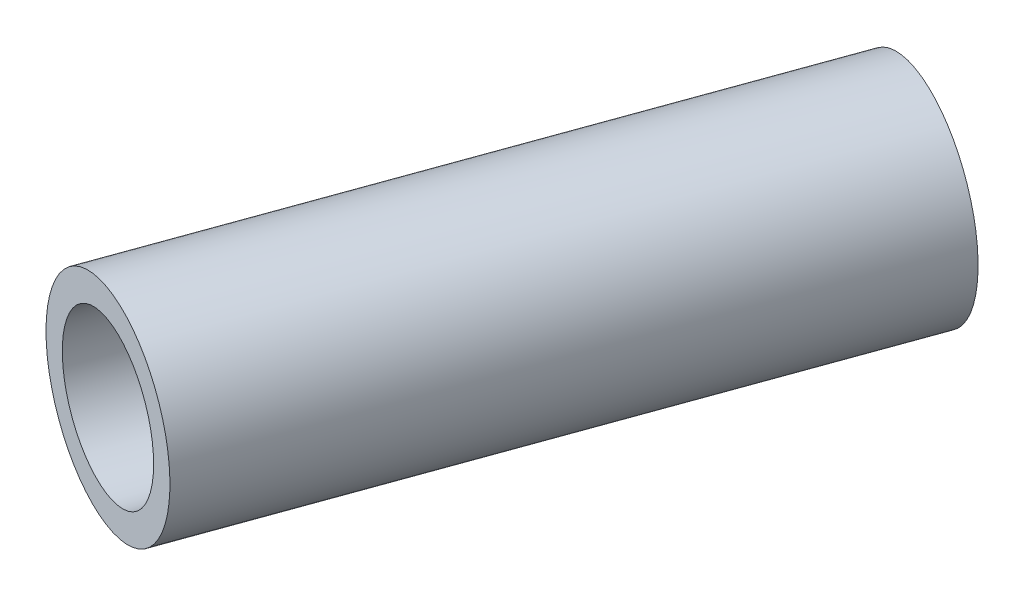
ISO-10303-21;
HEADER;
FILE_DESCRIPTION(('STEP AP214'),'2;1');
FILE_NAME('part.step','',(''),(''),'','','');
FILE_SCHEMA(('AUTOMOTIVE_DESIGN { 1 0 10303 214 1 1 1 1 }'));
ENDSEC;
DATA;
#1=APPLICATION_CONTEXT('core data for automotive mechanical design processes');
#2=APPLICATION_PROTOCOL_DEFINITION('international standard','automotive_design',2000,#1);
#3=PRODUCT_CONTEXT('',#1,'mechanical');
#4=PRODUCT('Part','Part','',(#3));
#5=PRODUCT_RELATED_PRODUCT_CATEGORY('part','',(#4));
#6=PRODUCT_DEFINITION_FORMATION('','',#4);
#7=PRODUCT_DEFINITION_CONTEXT('part definition',#1,'design');
#8=PRODUCT_DEFINITION('design','',#6,#7);
#9=PRODUCT_DEFINITION_SHAPE('','',#8);
#10=(LENGTH_UNIT() NAMED_UNIT(*) SI_UNIT(.MILLI.,.METRE.));
#11=(NAMED_UNIT(*) PLANE_ANGLE_UNIT() SI_UNIT($,.RADIAN.));
#12=(NAMED_UNIT(*) SI_UNIT($,.STERADIAN.) SOLID_ANGLE_UNIT());
#13=UNCERTAINTY_MEASURE_WITH_UNIT(LENGTH_MEASURE(1.E-05),#10,'distance_accuracy_value','');
#14=(GEOMETRIC_REPRESENTATION_CONTEXT(3) GLOBAL_UNCERTAINTY_ASSIGNED_CONTEXT((#13)) GLOBAL_UNIT_ASSIGNED_CONTEXT((#10,
#11,#12)) REPRESENTATION_CONTEXT('',''));
#15=CARTESIAN_POINT('',(0.,0.,0.));
#16=DIRECTION('',(0.,0.,1.));
#17=DIRECTION('',(1.,0.,0.));
#18=AXIS2_PLACEMENT_3D('',#15,#16,#17);
#19=CARTESIAN_POINT('',(246.501716043579,96.4929165128791,-211.708671654344));
#20=DIRECTION('',(-0.340654989152248,-0.000648546411340683,0.940188150187628));
#21=DIRECTION('',(0.940157744768088,-0.00830679038207239,0.340638242401129));
#22=AXIS2_PLACEMENT_3D('',#19,#20,#21);
#23=PLANE('',#22);
#24=CARTESIAN_POINT('',(246.501716043579,96.4929165128791,-211.708671654344));
#25=DIRECTION('',(0.340654989152249,0.000648546411340676,-0.940188150187628));
#26=DIRECTION('',(0.940157744768088,-0.00830679038207092,0.34063824240113));
#27=AXIS2_PLACEMENT_3D('',#24,#25,#26);
#28=CIRCLE('',#27,3.5);
#29=CARTESIAN_POINT('',(249.792268150267,96.4638427465418,-210.51643780594));
#30=VERTEX_POINT('',#29);
#31=EDGE_CURVE('E11',#30,#30,#28,.T.);
#32=ORIENTED_EDGE('',*,*,#31,.T.);
#33=EDGE_LOOP('',(#32));
#34=FACE_BOUND('',#33,.T.);
#35=CARTESIAN_POINT('',(246.501716043579,96.4929165128791,-211.708671654344));
#36=DIRECTION('',(0.340654989152248,0.000648546411340683,-0.940188150187628));
#37=DIRECTION('',(-0.940157744768088,0.00830679038207152,-0.340638242401129));
#38=AXIS2_PLACEMENT_3D('',#35,#36,#37);
#39=CIRCLE('',#38,4.75);
#40=CARTESIAN_POINT('',(242.035966755931,96.5323737671939,-213.326703305749));
#41=VERTEX_POINT('',#40);
#42=EDGE_CURVE('E43',#41,#41,#39,.T.);
#43=ORIENTED_EDGE('',*,*,#42,.F.);
#44=EDGE_LOOP('',(#43));
#45=FACE_BOUND('',#44,.T.);
#46=ADVANCED_FACE('F17',(#34,#45),#23,.T.);
#47=CARTESIAN_POINT('',(256.380710728994,96.511724358808,-238.974128009785));
#48=DIRECTION('',(-0.340654989152248,-0.000648546411340683,0.940188150187628));
#49=DIRECTION('',(0.940157744768088,-0.00830679038207239,0.340638242401129));
#50=AXIS2_PLACEMENT_3D('',#47,#48,#49);
#51=PLANE('',#50);
#52=CARTESIAN_POINT('',(256.380710728994,96.511724358808,-238.974128009785));
#53=DIRECTION('',(0.340654989152249,0.000648546411340676,-0.940188150187628));
#54=DIRECTION('',(0.940157744768088,-0.00830679038207086,0.34063824240113));
#55=AXIS2_PLACEMENT_3D('',#52,#53,#54);
#56=CIRCLE('',#55,3.5);
#57=CARTESIAN_POINT('',(259.671262835682,96.4826505924708,-237.781894161381));
#58=VERTEX_POINT('',#57);
#59=EDGE_CURVE('E38',#58,#58,#56,.T.);
#60=ORIENTED_EDGE('',*,*,#59,.F.);
#61=EDGE_LOOP('',(#60));
#62=FACE_BOUND('',#61,.T.);
#63=CARTESIAN_POINT('',(256.380710728994,96.511724358808,-238.974128009785));
#64=DIRECTION('',(0.340654989152248,0.000648546411340683,-0.940188150187628));
#65=DIRECTION('',(-0.940157744768088,0.00830679038207152,-0.340638242401129));
#66=AXIS2_PLACEMENT_3D('',#63,#64,#65);
#67=CIRCLE('',#66,4.75);
#68=CARTESIAN_POINT('',(251.914961441346,96.5511816131229,-240.59215966119));
#69=VERTEX_POINT('',#68);
#70=EDGE_CURVE('E21',#69,#69,#67,.T.);
#71=ORIENTED_EDGE('',*,*,#70,.T.);
#72=EDGE_LOOP('',(#71));
#73=FACE_BOUND('',#72,.T.);
#74=ADVANCED_FACE('F50',(#62,#73),#51,.F.);
#75=CARTESIAN_POINT('',(246.501716043579,96.4929165128791,-211.708671654344));
#76=DIRECTION('',(0.340654989152249,0.000648546411340676,-0.940188150187628));
#77=DIRECTION('',(-0.940157744768088,0.00830679038207092,-0.34063824240113));
#78=AXIS2_PLACEMENT_3D('',#75,#76,#77);
#79=CYLINDRICAL_SURFACE('',#78,3.5);
#80=ORIENTED_EDGE('',*,*,#31,.F.);
#81=EDGE_LOOP('',(#80));
#82=FACE_BOUND('',#81,.T.);
#83=ORIENTED_EDGE('',*,*,#59,.T.);
#84=EDGE_LOOP('',(#83));
#85=FACE_BOUND('',#84,.T.);
#86=ADVANCED_FACE('F57',(#82,#85),#79,.F.);
#87=CARTESIAN_POINT('',(246.501716043579,96.4929165128791,-211.708671654344));
#88=DIRECTION('',(0.340654989152249,0.000648546411340676,-0.940188150187628));
#89=DIRECTION('',(-0.940157744768088,0.00830679038207151,-0.34063824240113));
#90=AXIS2_PLACEMENT_3D('',#87,#88,#89);
#91=CYLINDRICAL_SURFACE('',#90,4.75);
#92=ORIENTED_EDGE('',*,*,#42,.T.);
#93=EDGE_LOOP('',(#92));
#94=FACE_BOUND('',#93,.T.);
#95=ORIENTED_EDGE('',*,*,#70,.F.);
#96=EDGE_LOOP('',(#95));
#97=FACE_BOUND('',#96,.T.);
#98=ADVANCED_FACE('F19',(#94,#97),#91,.T.);
#99=CLOSED_SHELL('',(#46,#74,#86,#98));
#100=MANIFOLD_SOLID_BREP('B1',#99);
#101=ADVANCED_BREP_SHAPE_REPRESENTATION('',(#18,#100),#14);
#102=SHAPE_DEFINITION_REPRESENTATION(#9,#101);
ENDSEC;
END-ISO-10303-21;
